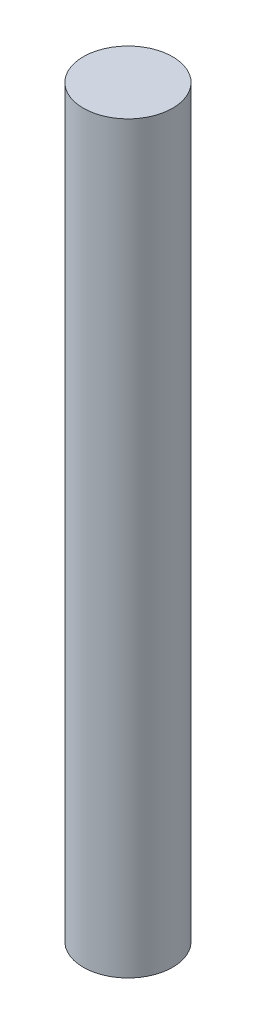
ISO-10303-21;
HEADER;
FILE_DESCRIPTION(('STEP AP214'),'2;1');
FILE_NAME('part.step','',(''),(''),'','','');
FILE_SCHEMA(('AUTOMOTIVE_DESIGN { 1 0 10303 214 1 1 1 1 }'));
ENDSEC;
DATA;
#1=APPLICATION_CONTEXT('core data for automotive mechanical design processes');
#2=APPLICATION_PROTOCOL_DEFINITION('international standard','automotive_design',2000,#1);
#3=PRODUCT_CONTEXT('',#1,'mechanical');
#4=PRODUCT('Part','Part','',(#3));
#5=PRODUCT_RELATED_PRODUCT_CATEGORY('part','',(#4));
#6=PRODUCT_DEFINITION_FORMATION('','',#4);
#7=PRODUCT_DEFINITION_CONTEXT('part definition',#1,'design');
#8=PRODUCT_DEFINITION('design','',#6,#7);
#9=PRODUCT_DEFINITION_SHAPE('','',#8);
#10=(LENGTH_UNIT() NAMED_UNIT(*) SI_UNIT(.MILLI.,.METRE.));
#11=(NAMED_UNIT(*) PLANE_ANGLE_UNIT() SI_UNIT($,.RADIAN.));
#12=(NAMED_UNIT(*) SI_UNIT($,.STERADIAN.) SOLID_ANGLE_UNIT());
#13=UNCERTAINTY_MEASURE_WITH_UNIT(LENGTH_MEASURE(1.E-05),#10,'distance_accuracy_value','');
#14=(GEOMETRIC_REPRESENTATION_CONTEXT(3) GLOBAL_UNCERTAINTY_ASSIGNED_CONTEXT((#13)) GLOBAL_UNIT_ASSIGNED_CONTEXT((#10,
#11,#12)) REPRESENTATION_CONTEXT('',''));
#15=CARTESIAN_POINT('',(0.,0.,0.));
#16=DIRECTION('',(0.,0.,1.));
#17=DIRECTION('',(1.,0.,0.));
#18=AXIS2_PLACEMENT_3D('',#15,#16,#17);
#19=CARTESIAN_POINT('',(0.,158.75,0.));
#20=DIRECTION('',(0.,-1.,0.));
#21=DIRECTION('',(0.,0.,-1.));
#22=AXIS2_PLACEMENT_3D('',#19,#20,#21);
#23=CYLINDRICAL_SURFACE('',#22,9.525);
#24=CARTESIAN_POINT('',(0.,158.75,0.));
#25=DIRECTION('',(0.,1.,0.));
#26=DIRECTION('',(0.,0.,1.));
#27=AXIS2_PLACEMENT_3D('',#24,#25,#26);
#28=CIRCLE('',#27,9.525);
#29=CARTESIAN_POINT('',(0.,158.75,9.525));
#30=VERTEX_POINT('',#29);
#31=EDGE_CURVE('E10',#30,#30,#28,.T.);
#32=ORIENTED_EDGE('',*,*,#31,.F.);
#33=EDGE_LOOP('',(#32));
#34=FACE_BOUND('',#33,.T.);
#35=CARTESIAN_POINT('',(0.,0.,0.));
#36=DIRECTION('',(0.,1.,0.));
#37=DIRECTION('',(0.,0.,1.));
#38=AXIS2_PLACEMENT_3D('',#35,#36,#37);
#39=CIRCLE('',#38,9.525);
#40=CARTESIAN_POINT('',(0.,0.,9.525));
#41=VERTEX_POINT('',#40);
#42=EDGE_CURVE('E35',#41,#41,#39,.T.);
#43=ORIENTED_EDGE('',*,*,#42,.T.);
#44=EDGE_LOOP('',(#43));
#45=FACE_BOUND('',#44,.T.);
#46=ADVANCED_FACE('F32',(#34,#45),#23,.T.);
#47=CARTESIAN_POINT('',(0.,158.75,0.));
#48=DIRECTION('',(0.,1.,0.));
#49=DIRECTION('',(0.,0.,1.));
#50=AXIS2_PLACEMENT_3D('',#47,#48,#49);
#51=PLANE('',#50);
#52=ORIENTED_EDGE('',*,*,#31,.T.);
#53=EDGE_LOOP('',(#52));
#54=FACE_BOUND('',#53,.T.);
#55=ADVANCED_FACE('F47',(#54),#51,.T.);
#56=CARTESIAN_POINT('',(0.,0.,0.));
#57=DIRECTION('',(0.,1.,0.));
#58=DIRECTION('',(0.,0.,1.));
#59=AXIS2_PLACEMENT_3D('',#56,#57,#58);
#60=PLANE('',#59);
#61=ORIENTED_EDGE('',*,*,#42,.F.);
#62=EDGE_LOOP('',(#61));
#63=FACE_BOUND('',#62,.T.);
#64=ADVANCED_FACE('F45',(#63),#60,.F.);
#65=CLOSED_SHELL('',(#46,#55,#64));
#66=MANIFOLD_SOLID_BREP('B2',#65);
#67=ADVANCED_BREP_SHAPE_REPRESENTATION('',(#18,#66),#14);
#68=SHAPE_DEFINITION_REPRESENTATION(#9,#67);
ENDSEC;
END-ISO-10303-21;
